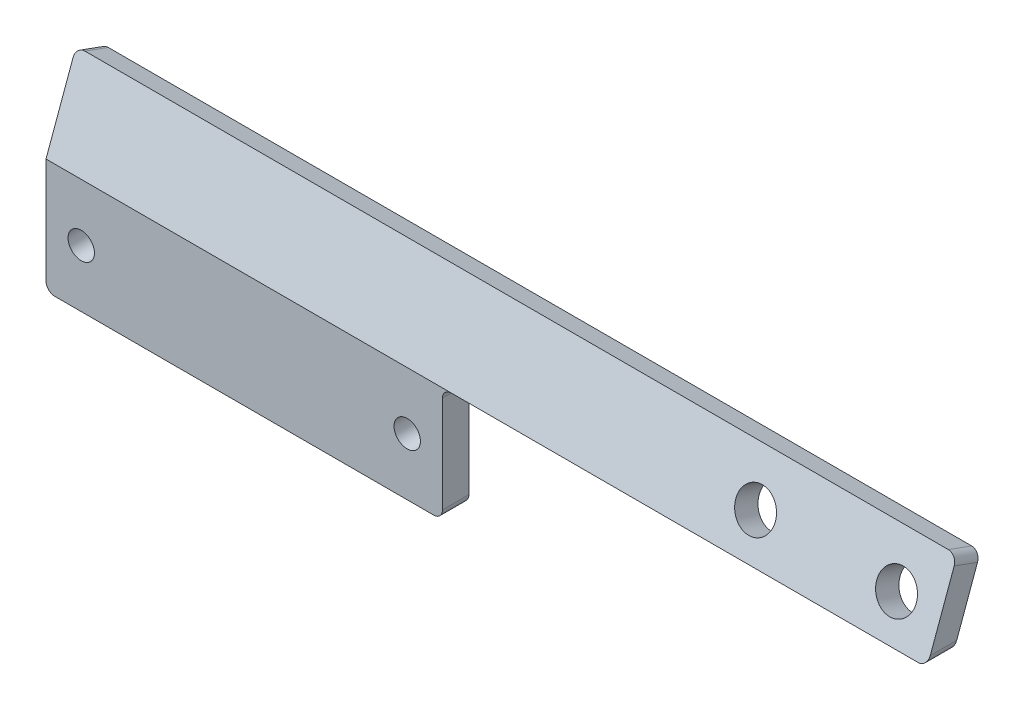
ISO-10303-21;
HEADER;
FILE_DESCRIPTION(('STEP AP214'),'2;1');
FILE_NAME('part.step','',(''),(''),'','','');
FILE_SCHEMA(('AUTOMOTIVE_DESIGN { 1 0 10303 214 1 1 1 1 }'));
ENDSEC;
DATA;
#1=APPLICATION_CONTEXT('core data for automotive mechanical design processes');
#2=APPLICATION_PROTOCOL_DEFINITION('international standard','automotive_design',2000,#1);
#3=PRODUCT_CONTEXT('',#1,'mechanical');
#4=PRODUCT('Part','Part','',(#3));
#5=PRODUCT_RELATED_PRODUCT_CATEGORY('part','',(#4));
#6=PRODUCT_DEFINITION_FORMATION('','',#4);
#7=PRODUCT_DEFINITION_CONTEXT('part definition',#1,'design');
#8=PRODUCT_DEFINITION('design','',#6,#7);
#9=PRODUCT_DEFINITION_SHAPE('','',#8);
#10=(LENGTH_UNIT() NAMED_UNIT(*) SI_UNIT(.MILLI.,.METRE.));
#11=(NAMED_UNIT(*) PLANE_ANGLE_UNIT() SI_UNIT($,.RADIAN.));
#12=(NAMED_UNIT(*) SI_UNIT($,.STERADIAN.) SOLID_ANGLE_UNIT());
#13=UNCERTAINTY_MEASURE_WITH_UNIT(LENGTH_MEASURE(1.E-05),#10,'distance_accuracy_value','');
#14=(GEOMETRIC_REPRESENTATION_CONTEXT(3) GLOBAL_UNCERTAINTY_ASSIGNED_CONTEXT((#13)) GLOBAL_UNIT_ASSIGNED_CONTEXT((#10,
#11,#12)) REPRESENTATION_CONTEXT('',''));
#15=CARTESIAN_POINT('',(0.,0.,0.));
#16=DIRECTION('',(0.,0.,1.));
#17=DIRECTION('',(1.,0.,0.));
#18=AXIS2_PLACEMENT_3D('',#15,#16,#17);
#19=CARTESIAN_POINT('',(0.,0.,3.));
#20=DIRECTION('',(0.,0.,-1.));
#21=DIRECTION('',(-1.,0.,0.));
#22=AXIS2_PLACEMENT_3D('',#19,#20,#21);
#23=PLANE('',#22);
#24=DIRECTION('',(1.,0.,0.));
#25=VECTOR('',#24,1.);
#26=CARTESIAN_POINT('',(0.,0.,3.));
#27=LINE('',#26,#25);
#28=CARTESIAN_POINT('',(1.,0.,3.));
#29=VERTEX_POINT('',#28);
#30=CARTESIAN_POINT('',(44.,0.,3.));
#31=VERTEX_POINT('',#30);
#32=EDGE_CURVE('E222',#29,#31,#27,.T.);
#33=ORIENTED_EDGE('',*,*,#32,.T.);
#34=CARTESIAN_POINT('',(44.,1.,3.));
#35=DIRECTION('',(0.,0.,-1.));
#36=DIRECTION('',(-1.,0.,0.));
#37=AXIS2_PLACEMENT_3D('',#34,#35,#36);
#38=CIRCLE('',#37,1.);
#39=CARTESIAN_POINT('',(45.,1.,3.));
#40=VERTEX_POINT('',#39);
#41=EDGE_CURVE('E156',#31,#40,#38,.F.);
#42=ORIENTED_EDGE('',*,*,#41,.T.);
#43=DIRECTION('',(0.,1.,0.));
#44=VECTOR('',#43,1.);
#45=CARTESIAN_POINT('',(45.,0.,3.));
#46=LINE('',#45,#44);
#47=CARTESIAN_POINT('',(45.,12.,3.));
#48=VERTEX_POINT('',#47);
#49=EDGE_CURVE('E224',#40,#48,#46,.T.);
#50=ORIENTED_EDGE('',*,*,#49,.T.);
#51=CARTESIAN_POINT('',(46.,12.,3.));
#52=DIRECTION('',(0.,0.,-1.));
#53=DIRECTION('',(-1.,0.,0.));
#54=AXIS2_PLACEMENT_3D('',#51,#52,#53);
#55=CIRCLE('',#54,1.);
#56=CARTESIAN_POINT('',(46.,13.,3.));
#57=VERTEX_POINT('',#56);
#58=EDGE_CURVE('E11',#48,#57,#55,.T.);
#59=ORIENTED_EDGE('',*,*,#58,.T.);
#60=DIRECTION('',(-1.,0.,0.));
#61=VECTOR('',#60,1.);
#62=CARTESIAN_POINT('',(0.,13.,3.));
#63=LINE('',#62,#61);
#64=CARTESIAN_POINT('',(0.,13.,3.));
#65=VERTEX_POINT('',#64);
#66=EDGE_CURVE('E47',#57,#65,#63,.T.);
#67=ORIENTED_EDGE('',*,*,#66,.T.);
#68=DIRECTION('',(0.,-1.,0.));
#69=VECTOR('',#68,1.);
#70=CARTESIAN_POINT('',(0.,0.,3.));
#71=LINE('',#70,#69);
#72=CARTESIAN_POINT('',(0.,1.,3.));
#73=VERTEX_POINT('',#72);
#74=EDGE_CURVE('E223',#65,#73,#71,.T.);
#75=ORIENTED_EDGE('',*,*,#74,.T.);
#76=CARTESIAN_POINT('',(1.,1.,3.));
#77=DIRECTION('',(0.,0.,-1.));
#78=DIRECTION('',(-1.,0.,0.));
#79=AXIS2_PLACEMENT_3D('',#76,#77,#78);
#80=CIRCLE('',#79,1.);
#81=EDGE_CURVE('E157',#73,#29,#80,.F.);
#82=ORIENTED_EDGE('',*,*,#81,.T.);
#83=EDGE_LOOP('',(#33,#42,#50,#59,#67,#75,#82));
#84=FACE_BOUND('',#83,.T.);
#85=CARTESIAN_POINT('',(41.,6.5,3.));
#86=DIRECTION('',(0.,0.,1.));
#87=DIRECTION('',(1.,0.,0.));
#88=AXIS2_PLACEMENT_3D('',#85,#86,#87);
#89=CIRCLE('',#88,1.5);
#90=CARTESIAN_POINT('',(42.5,6.5,3.));
#91=VERTEX_POINT('',#90);
#92=EDGE_CURVE('E262',#91,#91,#89,.T.);
#93=ORIENTED_EDGE('',*,*,#92,.F.);
#94=EDGE_LOOP('',(#93));
#95=FACE_BOUND('',#94,.T.);
#96=CARTESIAN_POINT('',(4.,6.5,3.));
#97=DIRECTION('',(0.,0.,-1.));
#98=DIRECTION('',(-1.,0.,0.));
#99=AXIS2_PLACEMENT_3D('',#96,#97,#98);
#100=CIRCLE('',#99,1.5);
#101=CARTESIAN_POINT('',(2.5,6.5,3.));
#102=VERTEX_POINT('',#101);
#103=EDGE_CURVE('E244',#102,#102,#100,.T.);
#104=ORIENTED_EDGE('',*,*,#103,.T.);
#105=EDGE_LOOP('',(#104));
#106=FACE_BOUND('',#105,.T.);
#107=ADVANCED_FACE('F32',(#84,#95,#106),#23,.F.);
#108=CARTESIAN_POINT('',(0.,0.,0.));
#109=DIRECTION('',(0.,0.,-1.));
#110=DIRECTION('',(-1.,0.,0.));
#111=AXIS2_PLACEMENT_3D('',#108,#109,#110);
#112=PLANE('',#111);
#113=DIRECTION('',(0.,1.,0.));
#114=VECTOR('',#113,1.);
#115=CARTESIAN_POINT('',(45.,0.,0.));
#116=LINE('',#115,#114);
#117=CARTESIAN_POINT('',(45.,1.,0.));
#118=VERTEX_POINT('',#117);
#119=CARTESIAN_POINT('',(45.,12.,0.));
#120=VERTEX_POINT('',#119);
#121=EDGE_CURVE('E142',#118,#120,#116,.T.);
#122=ORIENTED_EDGE('',*,*,#121,.F.);
#123=CARTESIAN_POINT('',(44.,1.,0.));
#124=DIRECTION('',(0.,0.,-1.));
#125=DIRECTION('',(-1.,0.,0.));
#126=AXIS2_PLACEMENT_3D('',#123,#124,#125);
#127=CIRCLE('',#126,1.);
#128=CARTESIAN_POINT('',(44.,0.,0.));
#129=VERTEX_POINT('',#128);
#130=EDGE_CURVE('E137',#118,#129,#127,.T.);
#131=ORIENTED_EDGE('',*,*,#130,.T.);
#132=DIRECTION('',(1.,0.,0.));
#133=VECTOR('',#132,1.);
#134=CARTESIAN_POINT('',(0.,0.,0.));
#135=LINE('',#134,#133);
#136=CARTESIAN_POINT('',(1.,0.,0.));
#137=VERTEX_POINT('',#136);
#138=EDGE_CURVE('E140',#137,#129,#135,.T.);
#139=ORIENTED_EDGE('',*,*,#138,.F.);
#140=CARTESIAN_POINT('',(1.,1.,0.));
#141=DIRECTION('',(0.,0.,-1.));
#142=DIRECTION('',(-1.,0.,0.));
#143=AXIS2_PLACEMENT_3D('',#140,#141,#142);
#144=CIRCLE('',#143,1.);
#145=CARTESIAN_POINT('',(0.,1.,0.));
#146=VERTEX_POINT('',#145);
#147=EDGE_CURVE('E147',#137,#146,#144,.T.);
#148=ORIENTED_EDGE('',*,*,#147,.T.);
#149=DIRECTION('',(0.,-1.,0.));
#150=VECTOR('',#149,1.);
#151=CARTESIAN_POINT('',(0.,0.,0.));
#152=LINE('',#151,#150);
#153=CARTESIAN_POINT('',(0.,13.,0.));
#154=VERTEX_POINT('',#153);
#155=EDGE_CURVE('E152',#154,#146,#152,.T.);
#156=ORIENTED_EDGE('',*,*,#155,.F.);
#157=DIRECTION('',(-1.,0.,0.));
#158=VECTOR('',#157,1.);
#159=CARTESIAN_POINT('',(0.,13.,0.));
#160=LINE('',#159,#158);
#161=CARTESIAN_POINT('',(46.,13.,0.));
#162=VERTEX_POINT('',#161);
#163=EDGE_CURVE('E70',#162,#154,#160,.T.);
#164=ORIENTED_EDGE('',*,*,#163,.F.);
#165=CARTESIAN_POINT('',(46.,12.,0.));
#166=DIRECTION('',(0.,0.,-1.));
#167=DIRECTION('',(-1.,0.,0.));
#168=AXIS2_PLACEMENT_3D('',#165,#166,#167);
#169=CIRCLE('',#168,1.);
#170=EDGE_CURVE('E40',#162,#120,#169,.F.);
#171=ORIENTED_EDGE('',*,*,#170,.T.);
#172=EDGE_LOOP('',(#122,#131,#139,#148,#156,#164,#171));
#173=FACE_BOUND('',#172,.T.);
#174=CARTESIAN_POINT('',(41.,6.5,0.));
#175=DIRECTION('',(0.,0.,1.));
#176=DIRECTION('',(1.,0.,0.));
#177=AXIS2_PLACEMENT_3D('',#174,#175,#176);
#178=CIRCLE('',#177,1.5);
#179=CARTESIAN_POINT('',(42.5,6.5,0.));
#180=VERTEX_POINT('',#179);
#181=EDGE_CURVE('E217',#180,#180,#178,.T.);
#182=ORIENTED_EDGE('',*,*,#181,.T.);
#183=EDGE_LOOP('',(#182));
#184=FACE_BOUND('',#183,.T.);
#185=CARTESIAN_POINT('',(4.,6.5,0.));
#186=DIRECTION('',(0.,0.,-1.));
#187=DIRECTION('',(-1.,0.,0.));
#188=AXIS2_PLACEMENT_3D('',#185,#186,#187);
#189=CIRCLE('',#188,1.5);
#190=CARTESIAN_POINT('',(2.5,6.5,0.));
#191=VERTEX_POINT('',#190);
#192=EDGE_CURVE('E259',#191,#191,#189,.T.);
#193=ORIENTED_EDGE('',*,*,#192,.F.);
#194=EDGE_LOOP('',(#193));
#195=FACE_BOUND('',#194,.T.);
#196=ADVANCED_FACE('F138',(#173,#184,#195),#112,.T.);
#197=CARTESIAN_POINT('',(0.,0.,3.));
#198=DIRECTION('',(1.,0.,0.));
#199=DIRECTION('',(0.,0.,-1.));
#200=AXIS2_PLACEMENT_3D('',#197,#198,#199);
#201=PLANE('',#200);
#202=DIRECTION('',(0.,0.939692620785908,-0.34202014332567));
#203=VECTOR('',#202,1.);
#204=CARTESIAN_POINT('',(0.,22.3969262078563,-0.420201433255672));
#205=LINE('',#204,#203);
#206=CARTESIAN_POINT('',(0.,21.4572335870704,-0.0781812899300026));
#207=VERTEX_POINT('',#206);
#208=EDGE_CURVE('E361',#65,#207,#205,.T.);
#209=ORIENTED_EDGE('',*,*,#208,.T.);
#210=DIRECTION('',(0.,-0.34202014332567,-0.939692620785908));
#211=VECTOR('',#210,1.);
#212=CARTESIAN_POINT('',(0.,20.4930521725405,-2.72724795460847));
#213=LINE('',#212,#211);
#214=CARTESIAN_POINT('',(0.,20.4930521725405,-2.72724795460847));
#215=VERTEX_POINT('',#214);
#216=EDGE_CURVE('E202',#207,#215,#213,.T.);
#217=ORIENTED_EDGE('',*,*,#216,.T.);
#218=DIRECTION('',(0.,-0.939692620785908,0.34202014332567));
#219=VECTOR('',#218,1.);
#220=CARTESIAN_POINT('',(0.,13.,0.));
#221=LINE('',#220,#219);
#222=EDGE_CURVE('E216',#215,#154,#221,.T.);
#223=ORIENTED_EDGE('',*,*,#222,.T.);
#224=ORIENTED_EDGE('',*,*,#155,.T.);
#225=DIRECTION('',(0.,0.,-1.));
#226=VECTOR('',#225,1.);
#227=CARTESIAN_POINT('',(0.,1.,3.));
#228=LINE('',#227,#226);
#229=EDGE_CURVE('E200',#146,#73,#228,.F.);
#230=ORIENTED_EDGE('',*,*,#229,.T.);
#231=ORIENTED_EDGE('',*,*,#74,.F.);
#232=EDGE_LOOP('',(#209,#217,#223,#224,#230,#231));
#233=FACE_BOUND('',#232,.T.);
#234=ADVANCED_FACE('F212',(#233),#201,.F.);
#235=CARTESIAN_POINT('',(0.,0.,3.));
#236=DIRECTION('',(0.,1.,0.));
#237=DIRECTION('',(0.,0.,1.));
#238=AXIS2_PLACEMENT_3D('',#235,#236,#237);
#239=PLANE('',#238);
#240=ORIENTED_EDGE('',*,*,#138,.T.);
#241=DIRECTION('',(0.,0.,-1.));
#242=VECTOR('',#241,1.);
#243=CARTESIAN_POINT('',(44.,0.,3.));
#244=LINE('',#243,#242);
#245=EDGE_CURVE('E56',#129,#31,#244,.F.);
#246=ORIENTED_EDGE('',*,*,#245,.T.);
#247=ORIENTED_EDGE('',*,*,#32,.F.);
#248=DIRECTION('',(0.,0.,-1.));
#249=VECTOR('',#248,1.);
#250=CARTESIAN_POINT('',(1.,0.,3.));
#251=LINE('',#250,#249);
#252=EDGE_CURVE('E146',#29,#137,#251,.T.);
#253=ORIENTED_EDGE('',*,*,#252,.T.);
#254=EDGE_LOOP('',(#240,#246,#247,#253));
#255=FACE_BOUND('',#254,.T.);
#256=ADVANCED_FACE('F150',(#255),#239,.F.);
#257=CARTESIAN_POINT('',(45.,0.,3.));
#258=DIRECTION('',(-1.,0.,0.));
#259=DIRECTION('',(0.,0.,1.));
#260=AXIS2_PLACEMENT_3D('',#257,#258,#259);
#261=PLANE('',#260);
#262=ORIENTED_EDGE('',*,*,#121,.T.);
#263=DIRECTION('',(0.,0.,-1.));
#264=VECTOR('',#263,1.);
#265=CARTESIAN_POINT('',(45.,12.,3.));
#266=LINE('',#265,#264);
#267=EDGE_CURVE('E169',#120,#48,#266,.F.);
#268=ORIENTED_EDGE('',*,*,#267,.T.);
#269=ORIENTED_EDGE('',*,*,#49,.F.);
#270=DIRECTION('',(0.,0.,-1.));
#271=VECTOR('',#270,1.);
#272=CARTESIAN_POINT('',(45.,1.,3.));
#273=LINE('',#272,#271);
#274=EDGE_CURVE('E171',#40,#118,#273,.T.);
#275=ORIENTED_EDGE('',*,*,#274,.T.);
#276=EDGE_LOOP('',(#262,#268,#269,#275));
#277=FACE_BOUND('',#276,.T.);
#278=ADVANCED_FACE('F167',(#277),#261,.F.);
#279=CARTESIAN_POINT('',(41.,6.5,0.));
#280=DIRECTION('',(0.,0.,1.));
#281=DIRECTION('',(1.,0.,0.));
#282=AXIS2_PLACEMENT_3D('',#279,#280,#281);
#283=CYLINDRICAL_SURFACE('',#282,1.5);
#284=ORIENTED_EDGE('',*,*,#181,.F.);
#285=EDGE_LOOP('',(#284));
#286=FACE_BOUND('',#285,.T.);
#287=ORIENTED_EDGE('',*,*,#92,.T.);
#288=EDGE_LOOP('',(#287));
#289=FACE_BOUND('',#288,.T.);
#290=ADVANCED_FACE('F269',(#286,#289),#283,.F.);
#291=CARTESIAN_POINT('',(4.,6.5,0.));
#292=DIRECTION('',(0.,0.,1.));
#293=DIRECTION('',(1.,0.,0.));
#294=AXIS2_PLACEMENT_3D('',#291,#292,#293);
#295=CYLINDRICAL_SURFACE('',#294,1.5);
#296=ORIENTED_EDGE('',*,*,#192,.T.);
#297=EDGE_LOOP('',(#296));
#298=FACE_BOUND('',#297,.T.);
#299=ORIENTED_EDGE('',*,*,#103,.F.);
#300=EDGE_LOOP('',(#299));
#301=FACE_BOUND('',#300,.T.);
#302=ADVANCED_FACE('F275',(#298,#301),#295,.F.);
#303=CARTESIAN_POINT('',(100.,13.,3.));
#304=DIRECTION('',(0.,-1.,0.));
#305=DIRECTION('',(0.,0.,-1.));
#306=AXIS2_PLACEMENT_3D('',#303,#304,#305);
#307=PLANE('',#306);
#308=DIRECTION('',(-1.,0.,0.));
#309=VECTOR('',#308,1.);
#310=CARTESIAN_POINT('',(100.,13.,3.));
#311=LINE('',#310,#309);
#312=CARTESIAN_POINT('',(99.,13.,3.));
#313=VERTEX_POINT('',#312);
#314=EDGE_CURVE('E246',#313,#57,#311,.T.);
#315=ORIENTED_EDGE('',*,*,#314,.T.);
#316=DIRECTION('',(0.,0.,-1.));
#317=VECTOR('',#316,1.);
#318=CARTESIAN_POINT('',(46.,13.,3.));
#319=LINE('',#318,#317);
#320=EDGE_CURVE('E179',#57,#162,#319,.T.);
#321=ORIENTED_EDGE('',*,*,#320,.T.);
#322=DIRECTION('',(-1.,0.,0.));
#323=VECTOR('',#322,1.);
#324=CARTESIAN_POINT('',(100.,13.,0.));
#325=LINE('',#324,#323);
#326=CARTESIAN_POINT('',(99.,13.,0.));
#327=VERTEX_POINT('',#326);
#328=EDGE_CURVE('E241',#327,#162,#325,.T.);
#329=ORIENTED_EDGE('',*,*,#328,.F.);
#330=DIRECTION('',(0.,0.,1.));
#331=VECTOR('',#330,1.);
#332=CARTESIAN_POINT('',(99.,13.,3.));
#333=LINE('',#332,#331);
#334=EDGE_CURVE('E238',#327,#313,#333,.T.);
#335=ORIENTED_EDGE('',*,*,#334,.T.);
#336=EDGE_LOOP('',(#315,#321,#329,#335));
#337=FACE_BOUND('',#336,.T.);
#338=ADVANCED_FACE('F277',(#337),#307,.T.);
#339=CARTESIAN_POINT('',(100.,13.,0.));
#340=DIRECTION('',(0.,-0.34202014332567,-0.939692620785908));
#341=DIRECTION('',(0.,0.939692620785908,-0.34202014332567));
#342=AXIS2_PLACEMENT_3D('',#339,#340,#341);
#343=PLANE('',#342);
#344=CARTESIAN_POINT('',(79.,16.2644353790068,-1.18815730964398));
#345=DIRECTION('',(0.,-0.34202014332567,-0.939692620785908));
#346=DIRECTION('',(0.,0.939692620785908,-0.34202014332567));
#347=AXIS2_PLACEMENT_3D('',#344,#345,#346);
#348=CIRCLE('',#347,2.25);
#349=CARTESIAN_POINT('',(79.,18.3787437757751,-1.95770263212673));
#350=VERTEX_POINT('',#349);
#351=EDGE_CURVE('E365',#350,#350,#348,.T.);
#352=ORIENTED_EDGE('',*,*,#351,.F.);
#353=EDGE_LOOP('',(#352));
#354=FACE_BOUND('',#353,.T.);
#355=CARTESIAN_POINT('',(95.,16.2644353790068,-1.18815730964398));
#356=DIRECTION('',(0.,-0.34202014332567,-0.939692620785908));
#357=DIRECTION('',(0.,0.939692620785908,-0.34202014332567));
#358=AXIS2_PLACEMENT_3D('',#355,#356,#357);
#359=CIRCLE('',#358,2.25);
#360=CARTESIAN_POINT('',(95.,18.3787437757751,-1.95770263212673));
#361=VERTEX_POINT('',#360);
#362=EDGE_CURVE('E362',#361,#361,#359,.T.);
#363=ORIENTED_EDGE('',*,*,#362,.F.);
#364=EDGE_LOOP('',(#363));
#365=FACE_BOUND('',#364,.T.);
#366=DIRECTION('',(0.,-0.939692620785908,0.34202014332567));
#367=VECTOR('',#366,1.);
#368=CARTESIAN_POINT('',(100.,13.,0.));
#369=LINE('',#368,#367);
#370=CARTESIAN_POINT('',(100.,20.4930521725405,-2.72724795460847));
#371=VERTEX_POINT('',#370);
#372=CARTESIAN_POINT('',(100.,14.,-0.363970234266203));
#373=VERTEX_POINT('',#372);
#374=EDGE_CURVE('E355',#371,#373,#369,.T.);
#375=ORIENTED_EDGE('',*,*,#374,.T.);
#376=CARTESIAN_POINT('',(99.,14.,-0.363970234266203));
#377=DIRECTION('',(0.,-0.34202014332567,-0.939692620785908));
#378=DIRECTION('',(0.,-0.939692620785908,0.34202014332567));
#379=AXIS2_PLACEMENT_3D('',#376,#377,#378);
#380=ELLIPSE('',#379,1.06417777247591,1.);
#381=EDGE_CURVE('E82',#373,#327,#380,.T.);
#382=ORIENTED_EDGE('',*,*,#381,.T.);
#383=ORIENTED_EDGE('',*,*,#328,.T.);
#384=ORIENTED_EDGE('',*,*,#163,.T.);
#385=ORIENTED_EDGE('',*,*,#222,.F.);
#386=CARTESIAN_POINT('',(1.,20.4930521725405,-2.72724795460847));
#387=DIRECTION('',(0.,-0.34202014332567,-0.939692620785908));
#388=DIRECTION('',(0.,0.939692620785908,-0.34202014332567));
#389=AXIS2_PLACEMENT_3D('',#386,#387,#388);
#390=CIRCLE('',#389,1.);
#391=CARTESIAN_POINT('',(1.,21.4327447933265,-3.06926809793414));
#392=VERTEX_POINT('',#391);
#393=EDGE_CURVE('E190',#215,#392,#390,.T.);
#394=ORIENTED_EDGE('',*,*,#393,.T.);
#395=DIRECTION('',(-1.,0.,0.));
#396=VECTOR('',#395,1.);
#397=CARTESIAN_POINT('',(100.,21.4327447933265,-3.06926809793414));
#398=LINE('',#397,#396);
#399=CARTESIAN_POINT('',(99.,21.4327447933265,-3.06926809793414));
#400=VERTEX_POINT('',#399);
#401=EDGE_CURVE('E245',#400,#392,#398,.T.);
#402=ORIENTED_EDGE('',*,*,#401,.F.);
#403=CARTESIAN_POINT('',(99.,20.4930521725405,-2.72724795460847));
#404=DIRECTION('',(0.,-0.34202014332567,-0.939692620785908));
#405=DIRECTION('',(0.,0.939692620785908,-0.34202014332567));
#406=AXIS2_PLACEMENT_3D('',#403,#404,#405);
#407=CIRCLE('',#406,1.);
#408=EDGE_CURVE('E192',#400,#371,#407,.T.);
#409=ORIENTED_EDGE('',*,*,#408,.T.);
#410=EDGE_LOOP('',(#375,#382,#383,#384,#385,#394,#402,#409));
#411=FACE_BOUND('',#410,.T.);
#412=ADVANCED_FACE('F284',(#354,#365,#411),#343,.T.);
#413=CARTESIAN_POINT('',(100.,21.4327447933265,-3.06926809793414));
#414=DIRECTION('',(0.,0.939692620785908,-0.34202014332567));
#415=DIRECTION('',(0.,0.34202014332567,0.939692620785908));
#416=AXIS2_PLACEMENT_3D('',#413,#414,#415);
#417=PLANE('',#416);
#418=DIRECTION('',(-1.,0.,0.));
#419=VECTOR('',#418,1.);
#420=CARTESIAN_POINT('',(100.,22.3969262078563,-0.420201433255672));
#421=LINE('',#420,#419);
#422=CARTESIAN_POINT('',(99.,22.3969262078563,-0.420201433255672));
#423=VERTEX_POINT('',#422);
#424=CARTESIAN_POINT('',(1.,22.3969262078563,-0.420201433255672));
#425=VERTEX_POINT('',#424);
#426=EDGE_CURVE('E255',#423,#425,#421,.T.);
#427=ORIENTED_EDGE('',*,*,#426,.F.);
#428=DIRECTION('',(0.,-0.34202014332567,-0.939692620785908));
#429=VECTOR('',#428,1.);
#430=CARTESIAN_POINT('',(99.,21.4327447933265,-3.06926809793414));
#431=LINE('',#430,#429);
#432=EDGE_CURVE('E197',#423,#400,#431,.T.);
#433=ORIENTED_EDGE('',*,*,#432,.T.);
#434=ORIENTED_EDGE('',*,*,#401,.T.);
#435=DIRECTION('',(0.,-0.34202014332567,-0.939692620785908));
#436=VECTOR('',#435,1.);
#437=CARTESIAN_POINT('',(1.,22.3969262078563,-0.420201433255671));
#438=LINE('',#437,#436);
#439=EDGE_CURVE('E195',#392,#425,#438,.F.);
#440=ORIENTED_EDGE('',*,*,#439,.T.);
#441=EDGE_LOOP('',(#427,#433,#434,#440));
#442=FACE_BOUND('',#441,.T.);
#443=ADVANCED_FACE('F338',(#442),#417,.T.);
#444=CARTESIAN_POINT('',(100.,22.3969262078563,-0.420201433255672));
#445=DIRECTION('',(0.,0.34202014332567,0.939692620785908));
#446=DIRECTION('',(0.,-0.939692620785908,0.34202014332567));
#447=AXIS2_PLACEMENT_3D('',#444,#445,#446);
#448=PLANE('',#447);
#449=CARTESIAN_POINT('',(79.,17.2286167935366,1.46090935503449));
#450=DIRECTION('',(0.,0.342020143325669,0.939692620785908));
#451=DIRECTION('',(0.,-0.939692620785908,0.342020143325669));
#452=AXIS2_PLACEMENT_3D('',#449,#450,#451);
#453=CIRCLE('',#452,2.25);
#454=CARTESIAN_POINT('',(79.,15.1143083967683,2.23045467751724));
#455=VERTEX_POINT('',#454);
#456=EDGE_CURVE('E349',#455,#455,#453,.T.);
#457=ORIENTED_EDGE('',*,*,#456,.F.);
#458=EDGE_LOOP('',(#457));
#459=FACE_BOUND('',#458,.T.);
#460=CARTESIAN_POINT('',(95.,17.2286167935366,1.46090935503449));
#461=DIRECTION('',(0.,0.342020143325669,0.939692620785908));
#462=DIRECTION('',(0.,-0.939692620785908,0.342020143325669));
#463=AXIS2_PLACEMENT_3D('',#460,#461,#462);
#464=CIRCLE('',#463,2.25);
#465=CARTESIAN_POINT('',(95.,15.1143083967683,2.23045467751724));
#466=VERTEX_POINT('',#465);
#467=EDGE_CURVE('E352',#466,#466,#464,.T.);
#468=ORIENTED_EDGE('',*,*,#467,.F.);
#469=EDGE_LOOP('',(#468));
#470=FACE_BOUND('',#469,.T.);
#471=ORIENTED_EDGE('',*,*,#314,.F.);
#472=CARTESIAN_POINT('',(99.,14.,2.6360297657338));
#473=DIRECTION('',(0.,0.34202014332567,0.939692620785908));
#474=DIRECTION('',(0.,-0.939692620785908,0.34202014332567));
#475=AXIS2_PLACEMENT_3D('',#472,#473,#474);
#476=ELLIPSE('',#475,1.06417777247591,1.);
#477=CARTESIAN_POINT('',(100.,14.,2.6360297657338));
#478=VERTEX_POINT('',#477);
#479=EDGE_CURVE('E184',#313,#478,#476,.T.);
#480=ORIENTED_EDGE('',*,*,#479,.T.);
#481=DIRECTION('',(0.,0.939692620785908,-0.34202014332567));
#482=VECTOR('',#481,1.);
#483=CARTESIAN_POINT('',(100.,22.3969262078563,-0.420201433255672));
#484=LINE('',#483,#482);
#485=CARTESIAN_POINT('',(100.,21.4572335870704,-0.0781812899300026));
#486=VERTEX_POINT('',#485);
#487=EDGE_CURVE('E356',#478,#486,#484,.T.);
#488=ORIENTED_EDGE('',*,*,#487,.T.);
#489=CARTESIAN_POINT('',(99.,21.4572335870704,-0.0781812899300024));
#490=DIRECTION('',(0.,0.34202014332567,0.939692620785908));
#491=DIRECTION('',(0.,-0.939692620785908,0.34202014332567));
#492=AXIS2_PLACEMENT_3D('',#489,#490,#491);
#493=CIRCLE('',#492,1.);
#494=EDGE_CURVE('E177',#486,#423,#493,.T.);
#495=ORIENTED_EDGE('',*,*,#494,.T.);
#496=ORIENTED_EDGE('',*,*,#426,.T.);
#497=CARTESIAN_POINT('',(1.,21.4572335870704,-0.0781812899300028));
#498=DIRECTION('',(0.,0.34202014332567,0.939692620785908));
#499=DIRECTION('',(0.,-0.939692620785908,0.34202014332567));
#500=AXIS2_PLACEMENT_3D('',#497,#498,#499);
#501=CIRCLE('',#500,1.);
#502=EDGE_CURVE('E175',#425,#207,#501,.T.);
#503=ORIENTED_EDGE('',*,*,#502,.T.);
#504=ORIENTED_EDGE('',*,*,#208,.F.);
#505=ORIENTED_EDGE('',*,*,#66,.F.);
#506=EDGE_LOOP('',(#471,#480,#488,#495,#496,#503,#504,#505));
#507=FACE_BOUND('',#506,.T.);
#508=ADVANCED_FACE('F334',(#459,#470,#507),#448,.T.);
#509=CARTESIAN_POINT('',(100.,0.,0.));
#510=DIRECTION('',(1.,0.,0.));
#511=DIRECTION('',(0.,0.,-1.));
#512=AXIS2_PLACEMENT_3D('',#509,#510,#511);
#513=PLANE('',#512);
#514=ORIENTED_EDGE('',*,*,#487,.F.);
#515=DIRECTION('',(0.,0.,1.));
#516=VECTOR('',#515,1.);
#517=CARTESIAN_POINT('',(100.,14.,0.));
#518=LINE('',#517,#516);
#519=EDGE_CURVE('E188',#478,#373,#518,.F.);
#520=ORIENTED_EDGE('',*,*,#519,.T.);
#521=ORIENTED_EDGE('',*,*,#374,.F.);
#522=DIRECTION('',(0.,-0.34202014332567,-0.939692620785908));
#523=VECTOR('',#522,1.);
#524=CARTESIAN_POINT('',(100.,18.9723410528139,-6.90536741757098));
#525=LINE('',#524,#523);
#526=EDGE_CURVE('E186',#371,#486,#525,.F.);
#527=ORIENTED_EDGE('',*,*,#526,.T.);
#528=EDGE_LOOP('',(#514,#520,#521,#527));
#529=FACE_BOUND('',#528,.T.);
#530=ADVANCED_FACE('F302',(#529),#513,.T.);
#531=CARTESIAN_POINT('',(46.,12.,3.));
#532=DIRECTION('',(0.,0.,-1.));
#533=DIRECTION('',(-1.,0.,0.));
#534=AXIS2_PLACEMENT_3D('',#531,#532,#533);
#535=CYLINDRICAL_SURFACE('',#534,1.);
#536=ORIENTED_EDGE('',*,*,#58,.F.);
#537=ORIENTED_EDGE('',*,*,#267,.F.);
#538=ORIENTED_EDGE('',*,*,#170,.F.);
#539=ORIENTED_EDGE('',*,*,#320,.F.);
#540=EDGE_LOOP('',(#536,#537,#538,#539));
#541=FACE_BOUND('',#540,.T.);
#542=ADVANCED_FACE('F174',(#541),#535,.F.);
#543=CARTESIAN_POINT('',(99.,14.,3.));
#544=DIRECTION('',(0.,0.,1.));
#545=DIRECTION('',(1.,0.,0.));
#546=AXIS2_PLACEMENT_3D('',#543,#544,#545);
#547=CYLINDRICAL_SURFACE('',#546,1.);
#548=ORIENTED_EDGE('',*,*,#381,.F.);
#549=ORIENTED_EDGE('',*,*,#519,.F.);
#550=ORIENTED_EDGE('',*,*,#479,.F.);
#551=ORIENTED_EDGE('',*,*,#334,.F.);
#552=EDGE_LOOP('',(#548,#549,#550,#551));
#553=FACE_BOUND('',#552,.T.);
#554=ADVANCED_FACE('F301',(#553),#547,.T.);
#555=CARTESIAN_POINT('',(99.,20.4930521725405,-2.72724795460847));
#556=DIRECTION('',(0.,-0.34202014332567,-0.939692620785908));
#557=DIRECTION('',(0.,0.939692620785908,-0.34202014332567));
#558=AXIS2_PLACEMENT_3D('',#555,#556,#557);
#559=CYLINDRICAL_SURFACE('',#558,1.);
#560=ORIENTED_EDGE('',*,*,#494,.F.);
#561=ORIENTED_EDGE('',*,*,#526,.F.);
#562=ORIENTED_EDGE('',*,*,#408,.F.);
#563=ORIENTED_EDGE('',*,*,#432,.F.);
#564=EDGE_LOOP('',(#560,#561,#562,#563));
#565=FACE_BOUND('',#564,.T.);
#566=ADVANCED_FACE('F305',(#565),#559,.T.);
#567=CARTESIAN_POINT('',(1.,19.9365224673437,-4.25630075289252));
#568=DIRECTION('',(0.,0.34202014332567,0.939692620785908));
#569=DIRECTION('',(0.,-0.939692620785908,0.34202014332567));
#570=AXIS2_PLACEMENT_3D('',#567,#568,#569);
#571=CYLINDRICAL_SURFACE('',#570,1.);
#572=ORIENTED_EDGE('',*,*,#502,.F.);
#573=ORIENTED_EDGE('',*,*,#439,.F.);
#574=ORIENTED_EDGE('',*,*,#393,.F.);
#575=ORIENTED_EDGE('',*,*,#216,.F.);
#576=EDGE_LOOP('',(#572,#573,#574,#575));
#577=FACE_BOUND('',#576,.T.);
#578=ADVANCED_FACE('F309',(#577),#571,.T.);
#579=CARTESIAN_POINT('',(44.,1.,3.));
#580=DIRECTION('',(0.,0.,-1.));
#581=DIRECTION('',(-1.,0.,0.));
#582=AXIS2_PLACEMENT_3D('',#579,#580,#581);
#583=CYLINDRICAL_SURFACE('',#582,1.);
#584=ORIENTED_EDGE('',*,*,#41,.F.);
#585=ORIENTED_EDGE('',*,*,#245,.F.);
#586=ORIENTED_EDGE('',*,*,#130,.F.);
#587=ORIENTED_EDGE('',*,*,#274,.F.);
#588=EDGE_LOOP('',(#584,#585,#586,#587));
#589=FACE_BOUND('',#588,.T.);
#590=ADVANCED_FACE('F155',(#589),#583,.T.);
#591=CARTESIAN_POINT('',(1.,1.,3.));
#592=DIRECTION('',(0.,0.,-1.));
#593=DIRECTION('',(-1.,0.,0.));
#594=AXIS2_PLACEMENT_3D('',#591,#592,#593);
#595=CYLINDRICAL_SURFACE('',#594,1.);
#596=ORIENTED_EDGE('',*,*,#81,.F.);
#597=ORIENTED_EDGE('',*,*,#229,.F.);
#598=ORIENTED_EDGE('',*,*,#147,.F.);
#599=ORIENTED_EDGE('',*,*,#252,.F.);
#600=EDGE_LOOP('',(#596,#597,#598,#599));
#601=FACE_BOUND('',#600,.T.);
#602=ADVANCED_FACE('F34',(#601),#595,.T.);
#603=CARTESIAN_POINT('',(95.,13.757280507201,-8.07650870700596));
#604=DIRECTION('',(0.,0.342020143325669,0.939692620785908));
#605=DIRECTION('',(0.,-0.939692620785908,0.342020143325669));
#606=AXIS2_PLACEMENT_3D('',#603,#604,#605);
#607=CYLINDRICAL_SURFACE('',#606,2.25);
#608=ORIENTED_EDGE('',*,*,#362,.T.);
#609=EDGE_LOOP('',(#608));
#610=FACE_BOUND('',#609,.T.);
#611=ORIENTED_EDGE('',*,*,#467,.T.);
#612=EDGE_LOOP('',(#611));
#613=FACE_BOUND('',#612,.T.);
#614=ADVANCED_FACE('F317',(#610,#613),#607,.F.);
#615=CARTESIAN_POINT('',(79.,13.757280507201,-8.07650870700596));
#616=DIRECTION('',(0.,0.342020143325669,0.939692620785908));
#617=DIRECTION('',(0.,-0.939692620785908,0.342020143325669));
#618=AXIS2_PLACEMENT_3D('',#615,#616,#617);
#619=CYLINDRICAL_SURFACE('',#618,2.25);
#620=ORIENTED_EDGE('',*,*,#351,.T.);
#621=EDGE_LOOP('',(#620));
#622=FACE_BOUND('',#621,.T.);
#623=ORIENTED_EDGE('',*,*,#456,.T.);
#624=EDGE_LOOP('',(#623));
#625=FACE_BOUND('',#624,.T.);
#626=ADVANCED_FACE('F321',(#622,#625),#619,.F.);
#627=CLOSED_SHELL('',(#107,#196,#234,#256,#278,#290,#302,#338,#412,#443,#508,#530,#542,#554,
#566,#578,#590,#602,#614,#626));
#628=MANIFOLD_SOLID_BREP('B2',#627);
#629=ADVANCED_BREP_SHAPE_REPRESENTATION('',(#18,#628),#14);
#630=SHAPE_DEFINITION_REPRESENTATION(#9,#629);
ENDSEC;
END-ISO-10303-21;
